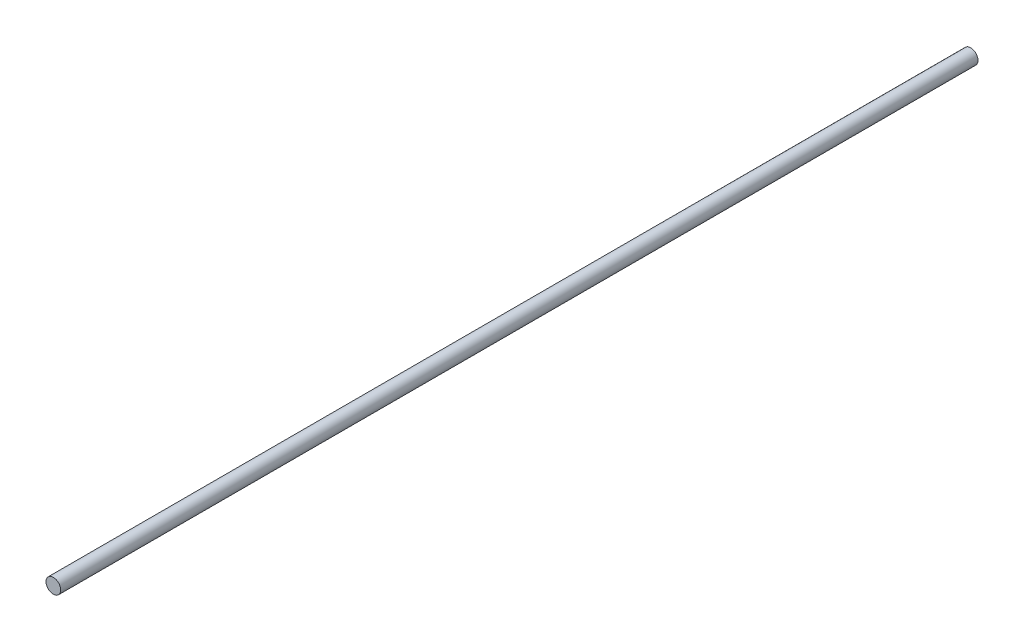
ISO-10303-21;
HEADER;
FILE_DESCRIPTION(('STEP AP214'),'2;1');
FILE_NAME('part.step','',(''),(''),'','','');
FILE_SCHEMA(('AUTOMOTIVE_DESIGN { 1 0 10303 214 1 1 1 1 }'));
ENDSEC;
DATA;
#1=APPLICATION_CONTEXT('core data for automotive mechanical design processes');
#2=APPLICATION_PROTOCOL_DEFINITION('international standard','automotive_design',2000,#1);
#3=PRODUCT_CONTEXT('',#1,'mechanical');
#4=PRODUCT('Part','Part','',(#3));
#5=PRODUCT_RELATED_PRODUCT_CATEGORY('part','',(#4));
#6=PRODUCT_DEFINITION_FORMATION('','',#4);
#7=PRODUCT_DEFINITION_CONTEXT('part definition',#1,'design');
#8=PRODUCT_DEFINITION('design','',#6,#7);
#9=PRODUCT_DEFINITION_SHAPE('','',#8);
#10=(LENGTH_UNIT() NAMED_UNIT(*) SI_UNIT(.MILLI.,.METRE.));
#11=(NAMED_UNIT(*) PLANE_ANGLE_UNIT() SI_UNIT($,.RADIAN.));
#12=(NAMED_UNIT(*) SI_UNIT($,.STERADIAN.) SOLID_ANGLE_UNIT());
#13=UNCERTAINTY_MEASURE_WITH_UNIT(LENGTH_MEASURE(1.E-05),#10,'distance_accuracy_value','');
#14=(GEOMETRIC_REPRESENTATION_CONTEXT(3) GLOBAL_UNCERTAINTY_ASSIGNED_CONTEXT((#13)) GLOBAL_UNIT_ASSIGNED_CONTEXT((#10,
#11,#12)) REPRESENTATION_CONTEXT('',''));
#15=CARTESIAN_POINT('',(0.,0.,0.));
#16=DIRECTION('',(0.,0.,1.));
#17=DIRECTION('',(1.,0.,0.));
#18=AXIS2_PLACEMENT_3D('',#15,#16,#17);
#19=CARTESIAN_POINT('',(0.,0.,250.));
#20=DIRECTION('',(0.,0.,-1.));
#21=DIRECTION('',(-1.,0.,0.));
#22=AXIS2_PLACEMENT_3D('',#19,#20,#21);
#23=CYLINDRICAL_SURFACE('',#22,2.);
#24=CARTESIAN_POINT('',(0.,0.,250.));
#25=DIRECTION('',(0.,0.,1.));
#26=DIRECTION('',(1.,0.,0.));
#27=AXIS2_PLACEMENT_3D('',#24,#25,#26);
#28=CIRCLE('',#27,2.);
#29=CARTESIAN_POINT('',(2.,0.,250.));
#30=VERTEX_POINT('',#29);
#31=EDGE_CURVE('E10',#30,#30,#28,.T.);
#32=ORIENTED_EDGE('',*,*,#31,.F.);
#33=EDGE_LOOP('',(#32));
#34=FACE_BOUND('',#33,.T.);
#35=CARTESIAN_POINT('',(0.,0.,0.));
#36=DIRECTION('',(0.,0.,1.));
#37=DIRECTION('',(1.,0.,0.));
#38=AXIS2_PLACEMENT_3D('',#35,#36,#37);
#39=CIRCLE('',#38,2.);
#40=CARTESIAN_POINT('',(2.,0.,0.));
#41=VERTEX_POINT('',#40);
#42=EDGE_CURVE('E34',#41,#41,#39,.T.);
#43=ORIENTED_EDGE('',*,*,#42,.T.);
#44=EDGE_LOOP('',(#43));
#45=FACE_BOUND('',#44,.T.);
#46=ADVANCED_FACE('F31',(#34,#45),#23,.T.);
#47=CARTESIAN_POINT('',(0.,0.,250.));
#48=DIRECTION('',(0.,0.,1.));
#49=DIRECTION('',(1.,0.,0.));
#50=AXIS2_PLACEMENT_3D('',#47,#48,#49);
#51=PLANE('',#50);
#52=ORIENTED_EDGE('',*,*,#31,.T.);
#53=EDGE_LOOP('',(#52));
#54=FACE_BOUND('',#53,.T.);
#55=ADVANCED_FACE('F46',(#54),#51,.T.);
#56=CARTESIAN_POINT('',(0.,0.,0.));
#57=DIRECTION('',(0.,0.,1.));
#58=DIRECTION('',(1.,0.,0.));
#59=AXIS2_PLACEMENT_3D('',#56,#57,#58);
#60=PLANE('',#59);
#61=ORIENTED_EDGE('',*,*,#42,.F.);
#62=EDGE_LOOP('',(#61));
#63=FACE_BOUND('',#62,.T.);
#64=ADVANCED_FACE('F44',(#63),#60,.F.);
#65=CLOSED_SHELL('',(#46,#55,#64));
#66=MANIFOLD_SOLID_BREP('B2',#65);
#67=ADVANCED_BREP_SHAPE_REPRESENTATION('',(#18,#66),#14);
#68=SHAPE_DEFINITION_REPRESENTATION(#9,#67);
ENDSEC;
END-ISO-10303-21;
